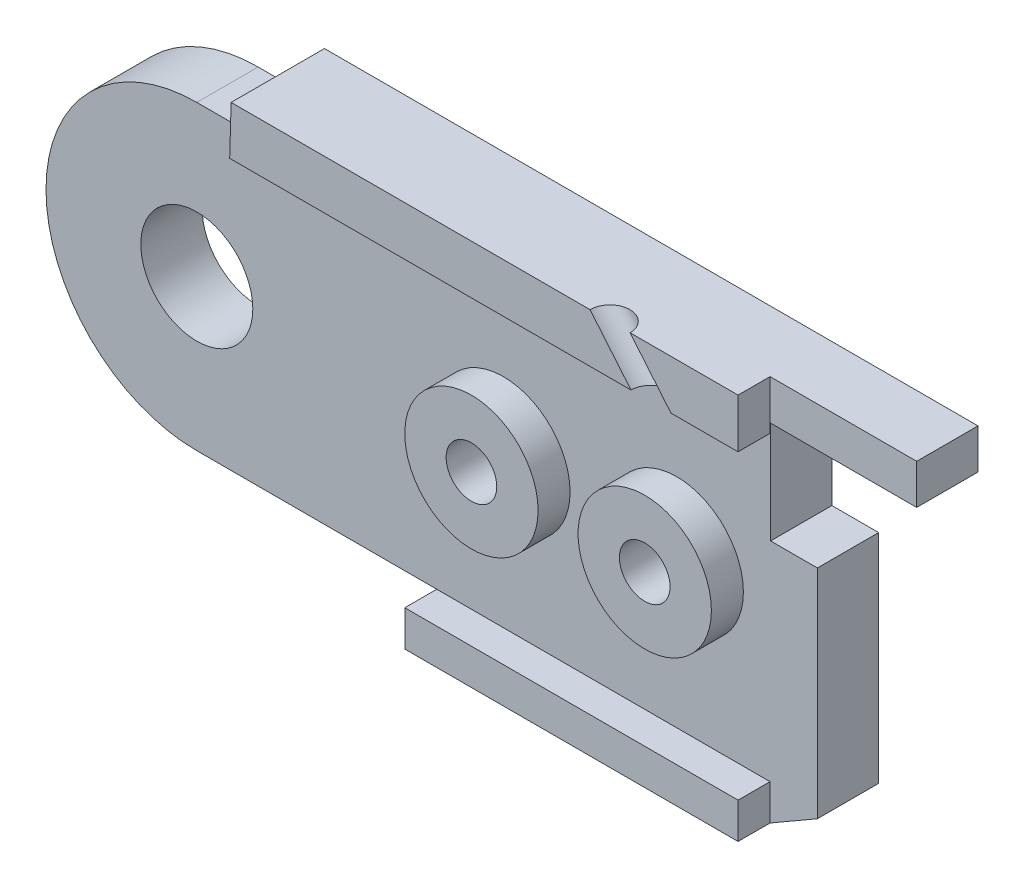
ISO-10303-21;
HEADER;
FILE_DESCRIPTION(('STEP AP214'),'2;1');
FILE_NAME('part.step','',(''),(''),'','','');
FILE_SCHEMA(('AUTOMOTIVE_DESIGN { 1 0 10303 214 1 1 1 1 }'));
ENDSEC;
DATA;
#1=APPLICATION_CONTEXT('core data for automotive mechanical design processes');
#2=APPLICATION_PROTOCOL_DEFINITION('international standard','automotive_design',2000,#1);
#3=PRODUCT_CONTEXT('',#1,'mechanical');
#4=PRODUCT('Part','Part','',(#3));
#5=PRODUCT_RELATED_PRODUCT_CATEGORY('part','',(#4));
#6=PRODUCT_DEFINITION_FORMATION('','',#4);
#7=PRODUCT_DEFINITION_CONTEXT('part definition',#1,'design');
#8=PRODUCT_DEFINITION('design','',#6,#7);
#9=PRODUCT_DEFINITION_SHAPE('','',#8);
#10=(LENGTH_UNIT() NAMED_UNIT(*) SI_UNIT(.MILLI.,.METRE.));
#11=(NAMED_UNIT(*) PLANE_ANGLE_UNIT() SI_UNIT($,.RADIAN.));
#12=(NAMED_UNIT(*) SI_UNIT($,.STERADIAN.) SOLID_ANGLE_UNIT());
#13=UNCERTAINTY_MEASURE_WITH_UNIT(LENGTH_MEASURE(1.E-05),#10,'distance_accuracy_value','');
#14=(GEOMETRIC_REPRESENTATION_CONTEXT(3) GLOBAL_UNCERTAINTY_ASSIGNED_CONTEXT((#13)) GLOBAL_UNIT_ASSIGNED_CONTEXT((#10,
#11,#12)) REPRESENTATION_CONTEXT('',''));
#15=CARTESIAN_POINT('',(0.,0.,0.));
#16=DIRECTION('',(0.,0.,1.));
#17=DIRECTION('',(1.,0.,0.));
#18=AXIS2_PLACEMENT_3D('',#15,#16,#17);
#19=CARTESIAN_POINT('',(0.,0.,8.));
#20=DIRECTION('',(0.,0.,1.));
#21=DIRECTION('',(1.,0.,0.));
#22=AXIS2_PLACEMENT_3D('',#19,#20,#21);
#23=PLANE('',#22);
#24=DIRECTION('',(0.640410196211525,-0.768033059567306,0.));
#25=VECTOR('',#24,1.);
#26=CARTESIAN_POINT('',(11.0813748573051,13.3371848451654,8.));
#27=LINE('',#26,#25);
#28=CARTESIAN_POINT('',(15.9486037421156,7.5,8.));
#29=VERTEX_POINT('',#28);
#30=CARTESIAN_POINT('',(17.4854768194204,5.65685424949238,8.));
#31=VERTEX_POINT('',#30);
#32=EDGE_CURVE('E12',#29,#31,#27,.T.);
#33=ORIENTED_EDGE('',*,*,#32,.F.);
#34=DIRECTION('',(-1.,0.,0.));
#35=VECTOR('',#34,1.);
#36=CARTESIAN_POINT('',(2.48679014755027,7.5,8.));
#37=LINE('',#36,#35);
#38=CARTESIAN_POINT('',(2.48679014755027,7.5,8.));
#39=VERTEX_POINT('',#38);
#40=EDGE_CURVE('E198',#29,#39,#37,.T.);
#41=ORIENTED_EDGE('',*,*,#40,.T.);
#42=DIRECTION('',(-0.0293404845923219,-0.999569475306188,0.));
#43=VECTOR('',#42,1.);
#44=CARTESIAN_POINT('',(2.48679014755027,7.5,8.));
#45=LINE('',#44,#43);
#46=CARTESIAN_POINT('',(2.4326880657739,5.65685424949238,8.));
#47=VERTEX_POINT('',#46);
#48=EDGE_CURVE('E191',#39,#47,#45,.T.);
#49=ORIENTED_EDGE('',*,*,#48,.T.);
#50=DIRECTION('',(1.,0.,0.));
#51=VECTOR('',#50,1.);
#52=CARTESIAN_POINT('',(2.4326880657739,5.65685424949238,8.));
#53=LINE('',#52,#51);
#54=EDGE_CURVE('E184',#47,#31,#53,.T.);
#55=ORIENTED_EDGE('',*,*,#54,.T.);
#56=EDGE_LOOP('',(#33,#41,#49,#55));
#57=FACE_BOUND('',#56,.T.);
#58=ADVANCED_FACE('F42',(#57),#23,.T.);
#59=CARTESIAN_POINT('',(0.,0.,6.8));
#60=DIRECTION('',(0.,0.,1.));
#61=DIRECTION('',(1.,0.,0.));
#62=AXIS2_PLACEMENT_3D('',#59,#60,#61);
#63=PLANE('',#62);
#64=CARTESIAN_POINT('',(18.,0.,6.8));
#65=DIRECTION('',(0.,0.,1.));
#66=DIRECTION('',(1.,0.,0.));
#67=AXIS2_PLACEMENT_3D('',#64,#65,#66);
#68=CIRCLE('',#67,2.5);
#69=CARTESIAN_POINT('',(20.5,0.,6.8));
#70=VERTEX_POINT('',#69);
#71=EDGE_CURVE('E436',#70,#70,#68,.T.);
#72=ORIENTED_EDGE('',*,*,#71,.F.);
#73=EDGE_LOOP('',(#72));
#74=FACE_BOUND('',#73,.T.);
#75=CARTESIAN_POINT('',(11.5,0.,6.8));
#76=DIRECTION('',(0.,0.,1.));
#77=DIRECTION('',(1.,0.,0.));
#78=AXIS2_PLACEMENT_3D('',#75,#76,#77);
#79=CIRCLE('',#78,2.5);
#80=CARTESIAN_POINT('',(14.,0.,6.8));
#81=VERTEX_POINT('',#80);
#82=EDGE_CURVE('E428',#81,#81,#79,.T.);
#83=ORIENTED_EDGE('',*,*,#82,.F.);
#84=EDGE_LOOP('',(#83));
#85=FACE_BOUND('',#84,.T.);
#86=DIRECTION('',(1.,0.,0.));
#87=VECTOR('',#86,1.);
#88=CARTESIAN_POINT('',(27.,2.1720062451962,6.8));
#89=LINE('',#88,#87);
#90=CARTESIAN_POINT('',(21.5203540034992,2.1720062451962,6.8));
#91=VERTEX_POINT('',#90);
#92=CARTESIAN_POINT('',(23.2751262658471,2.1720062451962,6.8));
#93=VERTEX_POINT('',#92);
#94=EDGE_CURVE('E421',#91,#93,#89,.T.);
#95=ORIENTED_EDGE('',*,*,#94,.F.);
#96=DIRECTION('',(0.,-1.,0.));
#97=VECTOR('',#96,1.);
#98=CARTESIAN_POINT('',(21.5203540034992,2.1720062451962,6.8));
#99=LINE('',#98,#97);
#100=CARTESIAN_POINT('',(21.5203540034992,6.,6.8));
#101=VERTEX_POINT('',#100);
#102=EDGE_CURVE('E415',#101,#91,#99,.T.);
#103=ORIENTED_EDGE('',*,*,#102,.F.);
#104=DIRECTION('',(-1.,0.,0.));
#105=VECTOR('',#104,1.);
#106=CARTESIAN_POINT('',(27.,6.,6.8));
#107=LINE('',#106,#105);
#108=CARTESIAN_POINT('',(27.,6.,6.8));
#109=VERTEX_POINT('',#108);
#110=EDGE_CURVE('E365',#109,#101,#107,.T.);
#111=ORIENTED_EDGE('',*,*,#110,.F.);
#112=DIRECTION('',(0.,1.,0.));
#113=VECTOR('',#112,1.);
#114=CARTESIAN_POINT('',(27.,7.5,6.8));
#115=LINE('',#114,#113);
#116=CARTESIAN_POINT('',(27.,7.5,6.8));
#117=VERTEX_POINT('',#116);
#118=EDGE_CURVE('E252',#109,#117,#115,.T.);
#119=ORIENTED_EDGE('',*,*,#118,.T.);
#120=DIRECTION('',(-1.,0.,0.));
#121=VECTOR('',#120,1.);
#122=CARTESIAN_POINT('',(27.,7.5,6.8));
#123=LINE('',#122,#121);
#124=CARTESIAN_POINT('',(21.5,7.5,6.8));
#125=VERTEX_POINT('',#124);
#126=EDGE_CURVE('E255',#117,#125,#123,.T.);
#127=ORIENTED_EDGE('',*,*,#126,.T.);
#128=DIRECTION('',(0.,1.,0.));
#129=VECTOR('',#128,1.);
#130=CARTESIAN_POINT('',(21.5,5.65685424949238,6.8));
#131=LINE('',#130,#129);
#132=CARTESIAN_POINT('',(21.5,5.65685424949238,6.8));
#133=VERTEX_POINT('',#132);
#134=EDGE_CURVE('E212',#133,#125,#131,.T.);
#135=ORIENTED_EDGE('',*,*,#134,.F.);
#136=DIRECTION('',(1.,0.,0.));
#137=VECTOR('',#136,1.);
#138=CARTESIAN_POINT('',(2.4326880657739,5.65685424949238,6.8));
#139=LINE('',#138,#137);
#140=CARTESIAN_POINT('',(2.4326880657739,5.65685424949238,6.8));
#141=VERTEX_POINT('',#140);
#142=EDGE_CURVE('E208',#141,#133,#139,.T.);
#143=ORIENTED_EDGE('',*,*,#142,.F.);
#144=DIRECTION('',(-1.,0.,0.));
#145=VECTOR('',#144,1.);
#146=CARTESIAN_POINT('',(2.4326880657739,5.65685424949238,6.8));
#147=LINE('',#146,#145);
#148=CARTESIAN_POINT('',(0.,5.65685424949238,6.8));
#149=VERTEX_POINT('',#148);
#150=EDGE_CURVE('E258',#141,#149,#147,.T.);
#151=ORIENTED_EDGE('',*,*,#150,.T.);
#152=CARTESIAN_POINT('',(0.,0.,6.8));
#153=DIRECTION('',(0.,0.,1.));
#154=DIRECTION('',(1.,0.,0.));
#155=AXIS2_PLACEMENT_3D('',#152,#153,#154);
#156=CIRCLE('',#155,5.65685424949238);
#157=CARTESIAN_POINT('',(0.,-5.65685424949238,6.8));
#158=VERTEX_POINT('',#157);
#159=EDGE_CURVE('E236',#149,#158,#156,.T.);
#160=ORIENTED_EDGE('',*,*,#159,.T.);
#161=DIRECTION('',(1.,0.,0.));
#162=VECTOR('',#161,1.);
#163=CARTESIAN_POINT('',(9.,-5.65685424949238,6.8));
#164=LINE('',#163,#162);
#165=CARTESIAN_POINT('',(9.,-5.65685424949238,6.8));
#166=VERTEX_POINT('',#165);
#167=EDGE_CURVE('E240',#158,#166,#164,.T.);
#168=ORIENTED_EDGE('',*,*,#167,.T.);
#169=DIRECTION('',(-1.,0.,0.));
#170=VECTOR('',#169,1.);
#171=CARTESIAN_POINT('',(21.5,-5.65685424949238,6.8));
#172=LINE('',#171,#170);
#173=CARTESIAN_POINT('',(21.5,-5.65685424949238,6.8));
#174=VERTEX_POINT('',#173);
#175=EDGE_CURVE('E404',#174,#166,#172,.T.);
#176=ORIENTED_EDGE('',*,*,#175,.F.);
#177=DIRECTION('',(0.,1.,0.));
#178=VECTOR('',#177,1.);
#179=CARTESIAN_POINT('',(21.5,-6.99999999999999,6.8));
#180=LINE('',#179,#178);
#181=CARTESIAN_POINT('',(21.5,-6.99999999999999,6.8));
#182=VERTEX_POINT('',#181);
#183=EDGE_CURVE('E401',#182,#174,#180,.T.);
#184=ORIENTED_EDGE('',*,*,#183,.F.);
#185=DIRECTION('',(0.865971186561437,0.500093895229063,0.));
#186=VECTOR('',#185,1.);
#187=CARTESIAN_POINT('',(21.5,-6.99999999999999,6.8));
#188=LINE('',#187,#186);
#189=CARTESIAN_POINT('',(23.2751262658471,-5.97487373415292,6.8));
#190=VERTEX_POINT('',#189);
#191=EDGE_CURVE('E245',#182,#190,#188,.T.);
#192=ORIENTED_EDGE('',*,*,#191,.T.);
#193=DIRECTION('',(0.,1.,0.));
#194=VECTOR('',#193,1.);
#195=CARTESIAN_POINT('',(23.2751262658471,-5.97487373415292,6.8));
#196=LINE('',#195,#194);
#197=EDGE_CURVE('E248',#190,#93,#196,.T.);
#198=ORIENTED_EDGE('',*,*,#197,.T.);
#199=EDGE_LOOP('',(#95,#103,#111,#119,#127,#135,#143,#151,#160,#168,#176,#184,#192,#198));
#200=FACE_BOUND('',#199,.T.);
#201=CARTESIAN_POINT('',(0.,0.,6.8));
#202=DIRECTION('',(0.,0.,1.));
#203=DIRECTION('',(1.,0.,0.));
#204=AXIS2_PLACEMENT_3D('',#201,#202,#203);
#205=CIRCLE('',#204,2.1);
#206=CARTESIAN_POINT('',(2.1,0.,6.8));
#207=VERTEX_POINT('',#206);
#208=EDGE_CURVE('E227',#207,#207,#205,.T.);
#209=ORIENTED_EDGE('',*,*,#208,.F.);
#210=EDGE_LOOP('',(#209));
#211=FACE_BOUND('',#210,.T.);
#212=ADVANCED_FACE('F360',(#74,#85,#200,#211),#63,.T.);
#213=CARTESIAN_POINT('',(0.,0.,6.8));
#214=DIRECTION('',(0.,0.,-1.));
#215=DIRECTION('',(-1.,0.,0.));
#216=AXIS2_PLACEMENT_3D('',#213,#214,#215);
#217=CYLINDRICAL_SURFACE('',#216,5.65685424949238);
#218=CARTESIAN_POINT('',(0.,0.,4.5));
#219=DIRECTION('',(0.,0.,1.));
#220=DIRECTION('',(1.,0.,0.));
#221=AXIS2_PLACEMENT_3D('',#218,#219,#220);
#222=CIRCLE('',#221,5.65685424949238);
#223=CARTESIAN_POINT('',(0.,5.65685424949238,4.5));
#224=VERTEX_POINT('',#223);
#225=CARTESIAN_POINT('',(0.,-5.65685424949238,4.5));
#226=VERTEX_POINT('',#225);
#227=EDGE_CURVE('E232',#224,#226,#222,.T.);
#228=ORIENTED_EDGE('',*,*,#227,.T.);
#229=DIRECTION('',(0.,0.,-1.));
#230=VECTOR('',#229,1.);
#231=CARTESIAN_POINT('',(0.,-5.65685424949238,6.8));
#232=LINE('',#231,#230);
#233=EDGE_CURVE('E326',#158,#226,#232,.T.);
#234=ORIENTED_EDGE('',*,*,#233,.F.);
#235=ORIENTED_EDGE('',*,*,#159,.F.);
#236=DIRECTION('',(0.,0.,-1.));
#237=VECTOR('',#236,1.);
#238=CARTESIAN_POINT('',(0.,5.65685424949238,6.8));
#239=LINE('',#238,#237);
#240=EDGE_CURVE('E261',#149,#224,#239,.T.);
#241=ORIENTED_EDGE('',*,*,#240,.T.);
#242=EDGE_LOOP('',(#228,#234,#235,#241));
#243=FACE_BOUND('',#242,.T.);
#244=ADVANCED_FACE('F44',(#243),#217,.T.);
#245=CARTESIAN_POINT('',(9.,-5.65685424949238,6.8));
#246=DIRECTION('',(0.,1.,0.));
#247=DIRECTION('',(0.,0.,1.));
#248=AXIS2_PLACEMENT_3D('',#245,#246,#247);
#249=PLANE('',#248);
#250=DIRECTION('',(1.,0.,0.));
#251=VECTOR('',#250,1.);
#252=CARTESIAN_POINT('',(9.,-5.65685424949238,4.5));
#253=LINE('',#252,#251);
#254=CARTESIAN_POINT('',(9.,-5.65685424949238,4.5));
#255=VERTEX_POINT('',#254);
#256=EDGE_CURVE('E265',#226,#255,#253,.T.);
#257=ORIENTED_EDGE('',*,*,#256,.T.);
#258=DIRECTION('',(0.,0.,-1.));
#259=VECTOR('',#258,1.);
#260=CARTESIAN_POINT('',(9.,-5.65685424949238,6.8));
#261=LINE('',#260,#259);
#262=EDGE_CURVE('E322',#166,#255,#261,.T.);
#263=ORIENTED_EDGE('',*,*,#262,.F.);
#264=ORIENTED_EDGE('',*,*,#167,.F.);
#265=ORIENTED_EDGE('',*,*,#233,.T.);
#266=EDGE_LOOP('',(#257,#263,#264,#265));
#267=FACE_BOUND('',#266,.T.);
#268=ADVANCED_FACE('F560',(#267),#249,.F.);
#269=CARTESIAN_POINT('',(9.,-6.99999999999999,6.8));
#270=DIRECTION('',(1.,0.,0.));
#271=DIRECTION('',(0.,0.,-1.));
#272=AXIS2_PLACEMENT_3D('',#269,#270,#271);
#273=PLANE('',#272);
#274=DIRECTION('',(0.,-1.,0.));
#275=VECTOR('',#274,1.);
#276=CARTESIAN_POINT('',(9.,-6.99999999999999,4.5));
#277=LINE('',#276,#275);
#278=CARTESIAN_POINT('',(9.,-6.99999999999999,4.5));
#279=VERTEX_POINT('',#278);
#280=EDGE_CURVE('E268',#255,#279,#277,.T.);
#281=ORIENTED_EDGE('',*,*,#280,.T.);
#282=DIRECTION('',(0.,0.,-1.));
#283=VECTOR('',#282,1.);
#284=CARTESIAN_POINT('',(9.,-6.99999999999999,6.8));
#285=LINE('',#284,#283);
#286=CARTESIAN_POINT('',(9.,-6.99999999999999,8.));
#287=VERTEX_POINT('',#286);
#288=EDGE_CURVE('E318',#287,#279,#285,.T.);
#289=ORIENTED_EDGE('',*,*,#288,.F.);
#290=DIRECTION('',(0.,-1.,0.));
#291=VECTOR('',#290,1.);
#292=CARTESIAN_POINT('',(9.,-5.65685424949238,8.));
#293=LINE('',#292,#291);
#294=CARTESIAN_POINT('',(9.,-5.65685424949238,8.));
#295=VERTEX_POINT('',#294);
#296=EDGE_CURVE('E393',#295,#287,#293,.T.);
#297=ORIENTED_EDGE('',*,*,#296,.F.);
#298=DIRECTION('',(0.,0.,-1.));
#299=VECTOR('',#298,1.);
#300=CARTESIAN_POINT('',(9.,-5.65685424949238,8.));
#301=LINE('',#300,#299);
#302=EDGE_CURVE('E213',#295,#166,#301,.T.);
#303=ORIENTED_EDGE('',*,*,#302,.T.);
#304=ORIENTED_EDGE('',*,*,#262,.T.);
#305=EDGE_LOOP('',(#281,#289,#297,#303,#304));
#306=FACE_BOUND('',#305,.T.);
#307=ADVANCED_FACE('F557',(#306),#273,.F.);
#308=CARTESIAN_POINT('',(9.,-6.99999999999999,6.8));
#309=DIRECTION('',(0.,1.,0.));
#310=DIRECTION('',(-1.,0.,0.));
#311=AXIS2_PLACEMENT_3D('',#308,#309,#310);
#312=PLANE('',#311);
#313=DIRECTION('',(1.,0.,0.));
#314=VECTOR('',#313,1.);
#315=CARTESIAN_POINT('',(9.,-6.99999999999999,4.5));
#316=LINE('',#315,#314);
#317=CARTESIAN_POINT('',(21.5,-6.99999999999999,4.5));
#318=VERTEX_POINT('',#317);
#319=EDGE_CURVE('E271',#279,#318,#316,.T.);
#320=ORIENTED_EDGE('',*,*,#319,.T.);
#321=DIRECTION('',(0.,0.,-1.));
#322=VECTOR('',#321,1.);
#323=CARTESIAN_POINT('',(21.5,-6.99999999999999,6.8));
#324=LINE('',#323,#322);
#325=EDGE_CURVE('E314',#182,#318,#324,.T.);
#326=ORIENTED_EDGE('',*,*,#325,.F.);
#327=DIRECTION('',(0.,0.,-1.));
#328=VECTOR('',#327,1.);
#329=CARTESIAN_POINT('',(21.5,-6.99999999999999,8.));
#330=LINE('',#329,#328);
#331=CARTESIAN_POINT('',(21.5,-6.99999999999999,8.));
#332=VERTEX_POINT('',#331);
#333=EDGE_CURVE('E381',#332,#182,#330,.T.);
#334=ORIENTED_EDGE('',*,*,#333,.F.);
#335=DIRECTION('',(1.,0.,0.));
#336=VECTOR('',#335,1.);
#337=CARTESIAN_POINT('',(9.,-6.99999999999999,8.));
#338=LINE('',#337,#336);
#339=EDGE_CURVE('E390',#287,#332,#338,.T.);
#340=ORIENTED_EDGE('',*,*,#339,.F.);
#341=ORIENTED_EDGE('',*,*,#288,.T.);
#342=EDGE_LOOP('',(#320,#326,#334,#340,#341));
#343=FACE_BOUND('',#342,.T.);
#344=ADVANCED_FACE('F553',(#343),#312,.F.);
#345=CARTESIAN_POINT('',(21.5,-6.99999999999999,6.8));
#346=DIRECTION('',(-0.500093895229063,0.865971186561437,0.));
#347=DIRECTION('',(-0.865971186561437,-0.500093895229063,0.));
#348=AXIS2_PLACEMENT_3D('',#345,#346,#347);
#349=PLANE('',#348);
#350=DIRECTION('',(0.865971186561437,0.500093895229063,0.));
#351=VECTOR('',#350,1.);
#352=CARTESIAN_POINT('',(21.5,-6.99999999999999,4.5));
#353=LINE('',#352,#351);
#354=CARTESIAN_POINT('',(23.2751262658471,-5.97487373415292,4.5));
#355=VERTEX_POINT('',#354);
#356=EDGE_CURVE('E274',#318,#355,#353,.T.);
#357=ORIENTED_EDGE('',*,*,#356,.T.);
#358=DIRECTION('',(0.,0.,-1.));
#359=VECTOR('',#358,1.);
#360=CARTESIAN_POINT('',(23.2751262658471,-5.97487373415292,6.8));
#361=LINE('',#360,#359);
#362=EDGE_CURVE('E310',#190,#355,#361,.T.);
#363=ORIENTED_EDGE('',*,*,#362,.F.);
#364=ORIENTED_EDGE('',*,*,#191,.F.);
#365=ORIENTED_EDGE('',*,*,#325,.T.);
#366=EDGE_LOOP('',(#357,#363,#364,#365));
#367=FACE_BOUND('',#366,.T.);
#368=ADVANCED_FACE('F547',(#367),#349,.F.);
#369=CARTESIAN_POINT('',(23.2751262658471,-5.97487373415292,6.8));
#370=DIRECTION('',(-1.,0.,0.));
#371=DIRECTION('',(0.,0.,1.));
#372=AXIS2_PLACEMENT_3D('',#369,#370,#371);
#373=PLANE('',#372);
#374=DIRECTION('',(0.,1.,0.));
#375=VECTOR('',#374,1.);
#376=CARTESIAN_POINT('',(23.2751262658471,-5.97487373415292,4.5));
#377=LINE('',#376,#375);
#378=CARTESIAN_POINT('',(23.2751262658471,2.1720062451962,4.5));
#379=VERTEX_POINT('',#378);
#380=EDGE_CURVE('E277',#355,#379,#377,.T.);
#381=ORIENTED_EDGE('',*,*,#380,.T.);
#382=DIRECTION('',(0.,0.,-1.));
#383=VECTOR('',#382,1.);
#384=CARTESIAN_POINT('',(23.2751262658471,2.1720062451962,6.8));
#385=LINE('',#384,#383);
#386=EDGE_CURVE('E307',#93,#379,#385,.T.);
#387=ORIENTED_EDGE('',*,*,#386,.F.);
#388=ORIENTED_EDGE('',*,*,#197,.F.);
#389=ORIENTED_EDGE('',*,*,#362,.T.);
#390=EDGE_LOOP('',(#381,#387,#388,#389));
#391=FACE_BOUND('',#390,.T.);
#392=ADVANCED_FACE('F543',(#391),#373,.F.);
#393=CARTESIAN_POINT('',(27.,7.5,6.8));
#394=DIRECTION('',(-1.,0.,0.));
#395=DIRECTION('',(0.,0.,1.));
#396=AXIS2_PLACEMENT_3D('',#393,#394,#395);
#397=PLANE('',#396);
#398=ORIENTED_EDGE('',*,*,#118,.F.);
#399=DIRECTION('',(0.,0.,1.));
#400=VECTOR('',#399,1.);
#401=CARTESIAN_POINT('',(27.,6.,4.4));
#402=LINE('',#401,#400);
#403=CARTESIAN_POINT('',(27.,6.,4.5));
#404=VERTEX_POINT('',#403);
#405=EDGE_CURVE('E370',#404,#109,#402,.T.);
#406=ORIENTED_EDGE('',*,*,#405,.F.);
#407=DIRECTION('',(0.,1.,0.));
#408=VECTOR('',#407,1.);
#409=CARTESIAN_POINT('',(27.,7.5,4.5));
#410=LINE('',#409,#408);
#411=CARTESIAN_POINT('',(27.,7.5,4.5));
#412=VERTEX_POINT('',#411);
#413=EDGE_CURVE('E281',#404,#412,#410,.T.);
#414=ORIENTED_EDGE('',*,*,#413,.T.);
#415=DIRECTION('',(0.,0.,-1.));
#416=VECTOR('',#415,1.);
#417=CARTESIAN_POINT('',(27.,7.5,6.8));
#418=LINE('',#417,#416);
#419=EDGE_CURVE('E303',#117,#412,#418,.T.);
#420=ORIENTED_EDGE('',*,*,#419,.F.);
#421=EDGE_LOOP('',(#398,#406,#414,#420));
#422=FACE_BOUND('',#421,.T.);
#423=ADVANCED_FACE('F368',(#422),#397,.F.);
#424=CARTESIAN_POINT('',(27.,7.5,6.8));
#425=DIRECTION('',(0.,-1.,0.));
#426=DIRECTION('',(1.,0.,0.));
#427=AXIS2_PLACEMENT_3D('',#424,#425,#426);
#428=PLANE('',#427);
#429=ORIENTED_EDGE('',*,*,#40,.F.);
#430=CARTESIAN_POINT('',(15.9486037421156,7.5,8.));
#431=CARTESIAN_POINT('',(15.9485828223259,7.5,7.96299421800191));
#432=CARTESIAN_POINT('',(15.9513415433594,7.5,7.92599480882229));
#433=CARTESIAN_POINT('',(15.9622658553059,7.5,7.85280214845709));
#434=CARTESIAN_POINT('',(15.9704314462188,7.5,7.81660889727152));
#435=CARTESIAN_POINT('',(15.9921393934185,7.5,7.74542087657391));
#436=CARTESIAN_POINT('',(16.0057416320877,7.5,7.71044433655034));
#437=CARTESIAN_POINT('',(16.038007282868,7.5,7.64291055089048));
#438=CARTESIAN_POINT('',(16.0566711070594,7.5,7.61035350250797));
#439=CARTESIAN_POINT('',(16.1009739517884,7.5,7.54495610451522));
#440=CARTESIAN_POINT('',(16.1271556218163,7.5,7.51248144744488));
#441=CARTESIAN_POINT('',(16.1845300787262,7.5,7.45231690208434));
#442=CARTESIAN_POINT('',(16.215722865608,7.5,7.42462701379413));
#443=CARTESIAN_POINT('',(16.2822616845173,7.5,7.37479057971385));
#444=CARTESIAN_POINT('',(16.3176077165447,7.5,7.3526440339238));
#445=CARTESIAN_POINT('',(16.3914774729578,7.5,7.3145064968947));
#446=CARTESIAN_POINT('',(16.4300011973436,7.5,7.29851550565565));
#447=CARTESIAN_POINT('',(16.509163978992,7.5,7.27312976103131));
#448=CARTESIAN_POINT('',(16.5498030362547,7.5,7.26373500764601));
#449=CARTESIAN_POINT('',(16.632075555852,7.5,7.25180095836177));
#450=CARTESIAN_POINT('',(16.6737090181867,7.5,7.24926166246284));
#451=CARTESIAN_POINT('',(16.7568220529829,7.5,7.2511085370352));
#452=CARTESIAN_POINT('',(16.7983016254444,7.5,7.25549470750648));
#453=CARTESIAN_POINT('',(16.8799628150021,7.5,7.27107155208883));
#454=CARTESIAN_POINT('',(16.9201444320982,7.5,7.28226222619989));
#455=CARTESIAN_POINT('',(16.9981014450578,7.5,7.31113939718431));
#456=CARTESIAN_POINT('',(17.0358768409213,7.5,7.32882589405766));
#457=CARTESIAN_POINT('',(17.1079795264237,7.5,7.37020698670185));
#458=CARTESIAN_POINT('',(17.1423068160626,7.5,7.3939015824727));
#459=CARTESIAN_POINT('',(17.2065664512203,7.5,7.44664499570797));
#460=CARTESIAN_POINT('',(17.2364987967392,7.5,7.4756938131724));
#461=CARTESIAN_POINT('',(17.2911431356884,7.5,7.5383457625048));
#462=CARTESIAN_POINT('',(17.3158551291189,7.5,7.57194889437277));
#463=CARTESIAN_POINT('',(17.3593765510825,7.5,7.64277780637736));
#464=CARTESIAN_POINT('',(17.3781859796156,7.5,7.68000358651398));
#465=CARTESIAN_POINT('',(17.4093858052971,7.5,7.75706914341449));
#466=CARTESIAN_POINT('',(17.4217762024454,7.5,7.79690892017838));
#467=CARTESIAN_POINT('',(17.4366988841339,7.5,7.86412407662256));
#468=CARTESIAN_POINT('',(17.4411547413667,7.5,7.89108809517031));
#469=CARTESIAN_POINT('',(17.4471101011285,7.5,7.945363879891));
#470=CARTESIAN_POINT('',(17.4486070790076,7.5,7.97267592303649));
#471=CARTESIAN_POINT('',(17.4486037421156,7.5,7.99999999999999));
#472=B_SPLINE_CURVE_WITH_KNOTS('',3,(#430,#431,#432,#433,#434,#435,#436,#437,#438,#439,#440,
#441,#442,#443,#444,#445,#446,#447,#448,#449,#450,#451,#452,#453,#454,#455,#456,#457,#458,#459,
#460,#461,#462,#463,#464,#465,#466,#467,#468,#469,#470,#471),.UNSPECIFIED.,.F.,.F.,(4,2,2,2,2,2,
2,2,2,2,2,2,2,2,2,2,2,2,2,2,4),(0.,0.110905075743071,0.221810151486143,0.333972034634098,
0.446143051990056,0.570700323775496,0.695257595560365,0.819814867345232,0.944372139130096,
1.06892941091496,1.19348668269983,1.31804395448469,1.44260122626956,1.56715849805442,
1.69171576983929,1.81627304162415,1.94083031340901,2.06538758519388,2.18994485697874,
2.27178284385731,2.35369062852365),.UNSPECIFIED.);
#473=CARTESIAN_POINT('',(17.4486037421156,7.5,8.));
#474=VERTEX_POINT('',#473);
#475=EDGE_CURVE('E176',#29,#474,#472,.T.);
#476=ORIENTED_EDGE('',*,*,#475,.T.);
#477=CARTESIAN_POINT('',(21.5,7.5,8.));
#478=VERTEX_POINT('',#477);
#479=EDGE_CURVE('E203',#478,#474,#37,.T.);
#480=ORIENTED_EDGE('',*,*,#479,.F.);
#481=DIRECTION('',(0.,0.,-1.));
#482=VECTOR('',#481,1.);
#483=CARTESIAN_POINT('',(21.5,7.5,8.));
#484=LINE('',#483,#482);
#485=EDGE_CURVE('E207',#478,#125,#484,.T.);
#486=ORIENTED_EDGE('',*,*,#485,.T.);
#487=ORIENTED_EDGE('',*,*,#126,.F.);
#488=ORIENTED_EDGE('',*,*,#419,.T.);
#489=DIRECTION('',(-1.,0.,0.));
#490=VECTOR('',#489,1.);
#491=CARTESIAN_POINT('',(27.,7.5,4.5));
#492=LINE('',#491,#490);
#493=CARTESIAN_POINT('',(2.48679014755027,7.5,4.5));
#494=VERTEX_POINT('',#493);
#495=EDGE_CURVE('E284',#412,#494,#492,.T.);
#496=ORIENTED_EDGE('',*,*,#495,.T.);
#497=DIRECTION('',(0.,0.,-1.));
#498=VECTOR('',#497,1.);
#499=CARTESIAN_POINT('',(2.48679014755027,7.5,6.8));
#500=LINE('',#499,#498);
#501=EDGE_CURVE('E299',#39,#494,#500,.T.);
#502=ORIENTED_EDGE('',*,*,#501,.F.);
#503=EDGE_LOOP('',(#429,#476,#480,#486,#487,#488,#496,#502));
#504=FACE_BOUND('',#503,.T.);
#505=ADVANCED_FACE('F345',(#504),#428,.F.);
#506=CARTESIAN_POINT('',(2.4326880657739,5.65685424949238,6.8));
#507=DIRECTION('',(0.999569475306188,-0.0293404845923219,0.));
#508=DIRECTION('',(0.0293404845923219,0.999569475306188,0.));
#509=AXIS2_PLACEMENT_3D('',#506,#507,#508);
#510=PLANE('',#509);
#511=DIRECTION('',(-0.0293404845923219,-0.999569475306188,0.));
#512=VECTOR('',#511,1.);
#513=CARTESIAN_POINT('',(2.4326880657739,5.65685424949238,4.5));
#514=LINE('',#513,#512);
#515=CARTESIAN_POINT('',(2.4326880657739,5.65685424949238,4.5));
#516=VERTEX_POINT('',#515);
#517=EDGE_CURVE('E287',#494,#516,#514,.T.);
#518=ORIENTED_EDGE('',*,*,#517,.T.);
#519=DIRECTION('',(0.,0.,-1.));
#520=VECTOR('',#519,1.);
#521=CARTESIAN_POINT('',(2.4326880657739,5.65685424949238,6.8));
#522=LINE('',#521,#520);
#523=EDGE_CURVE('E295',#141,#516,#522,.T.);
#524=ORIENTED_EDGE('',*,*,#523,.F.);
#525=DIRECTION('',(0.,0.,-1.));
#526=VECTOR('',#525,1.);
#527=CARTESIAN_POINT('',(2.4326880657739,5.65685424949238,8.));
#528=LINE('',#527,#526);
#529=EDGE_CURVE('E224',#47,#141,#528,.T.);
#530=ORIENTED_EDGE('',*,*,#529,.F.);
#531=ORIENTED_EDGE('',*,*,#48,.F.);
#532=ORIENTED_EDGE('',*,*,#501,.T.);
#533=EDGE_LOOP('',(#518,#524,#530,#531,#532));
#534=FACE_BOUND('',#533,.T.);
#535=ADVANCED_FACE('F376',(#534),#510,.F.);
#536=CARTESIAN_POINT('',(2.4326880657739,5.65685424949238,6.8));
#537=DIRECTION('',(0.,-1.,0.));
#538=DIRECTION('',(0.,0.,-1.));
#539=AXIS2_PLACEMENT_3D('',#536,#537,#538);
#540=PLANE('',#539);
#541=DIRECTION('',(-1.,0.,0.));
#542=VECTOR('',#541,1.);
#543=CARTESIAN_POINT('',(2.4326880657739,5.65685424949238,4.5));
#544=LINE('',#543,#542);
#545=EDGE_CURVE('E241',#516,#224,#544,.T.);
#546=ORIENTED_EDGE('',*,*,#545,.T.);
#547=ORIENTED_EDGE('',*,*,#240,.F.);
#548=ORIENTED_EDGE('',*,*,#150,.F.);
#549=ORIENTED_EDGE('',*,*,#523,.T.);
#550=EDGE_LOOP('',(#546,#547,#548,#549));
#551=FACE_BOUND('',#550,.T.);
#552=ADVANCED_FACE('F526',(#551),#540,.F.);
#553=CARTESIAN_POINT('',(0.,0.,4.5));
#554=DIRECTION('',(0.,0.,1.));
#555=DIRECTION('',(1.,0.,0.));
#556=AXIS2_PLACEMENT_3D('',#553,#554,#555);
#557=CYLINDRICAL_SURFACE('',#556,2.1);
#558=CARTESIAN_POINT('',(0.,0.,4.5));
#559=DIRECTION('',(0.,0.,1.));
#560=DIRECTION('',(1.,0.,0.));
#561=AXIS2_PLACEMENT_3D('',#558,#559,#560);
#562=CIRCLE('',#561,2.1);
#563=CARTESIAN_POINT('',(2.1,0.,4.5));
#564=VERTEX_POINT('',#563);
#565=EDGE_CURVE('E228',#564,#564,#562,.T.);
#566=ORIENTED_EDGE('',*,*,#565,.F.);
#567=EDGE_LOOP('',(#566));
#568=FACE_BOUND('',#567,.T.);
#569=ORIENTED_EDGE('',*,*,#208,.T.);
#570=EDGE_LOOP('',(#569));
#571=FACE_BOUND('',#570,.T.);
#572=ADVANCED_FACE('F523',(#568,#571),#557,.F.);
#573=CARTESIAN_POINT('',(2.4326880657739,5.65685424949238,8.));
#574=DIRECTION('',(0.,1.,0.));
#575=DIRECTION('',(0.,0.,1.));
#576=AXIS2_PLACEMENT_3D('',#573,#574,#575);
#577=PLANE('',#576);
#578=CARTESIAN_POINT('',(18.9854768194204,5.65685424949238,8.));
#579=VERTEX_POINT('',#578);
#580=CARTESIAN_POINT('',(21.5,5.65685424949238,8.));
#581=VERTEX_POINT('',#580);
#582=EDGE_CURVE('E187',#579,#581,#53,.T.);
#583=ORIENTED_EDGE('',*,*,#582,.F.);
#584=CARTESIAN_POINT('',(18.2354768194204,5.65685424949238,8.));
#585=DIRECTION('',(0.,-1.,0.));
#586=DIRECTION('',(0.,0.,-1.));
#587=AXIS2_PLACEMENT_3D('',#584,#585,#586);
#588=CIRCLE('',#587,0.750000000000002);
#589=EDGE_CURVE('E57',#31,#579,#588,.T.);
#590=ORIENTED_EDGE('',*,*,#589,.F.);
#591=ORIENTED_EDGE('',*,*,#54,.F.);
#592=ORIENTED_EDGE('',*,*,#529,.T.);
#593=ORIENTED_EDGE('',*,*,#142,.T.);
#594=DIRECTION('',(0.,0.,-1.));
#595=VECTOR('',#594,1.);
#596=CARTESIAN_POINT('',(21.5,5.65685424949238,8.));
#597=LINE('',#596,#595);
#598=EDGE_CURVE('E220',#581,#133,#597,.T.);
#599=ORIENTED_EDGE('',*,*,#598,.F.);
#600=EDGE_LOOP('',(#583,#590,#591,#592,#593,#599));
#601=FACE_BOUND('',#600,.T.);
#602=ADVANCED_FACE('F182',(#601),#577,.F.);
#603=CARTESIAN_POINT('',(21.5,5.65685424949238,8.));
#604=DIRECTION('',(-1.,0.,0.));
#605=DIRECTION('',(0.,0.,1.));
#606=AXIS2_PLACEMENT_3D('',#603,#604,#605);
#607=PLANE('',#606);
#608=ORIENTED_EDGE('',*,*,#134,.T.);
#609=ORIENTED_EDGE('',*,*,#485,.F.);
#610=DIRECTION('',(0.,1.,0.));
#611=VECTOR('',#610,1.);
#612=CARTESIAN_POINT('',(21.5,5.65685424949238,8.));
#613=LINE('',#612,#611);
#614=EDGE_CURVE('E194',#581,#478,#613,.T.);
#615=ORIENTED_EDGE('',*,*,#614,.F.);
#616=ORIENTED_EDGE('',*,*,#598,.T.);
#617=EDGE_LOOP('',(#608,#609,#615,#616));
#618=FACE_BOUND('',#617,.T.);
#619=ADVANCED_FACE('F354',(#618),#607,.F.);
#620=DIRECTION('',(0.640410196211525,-0.768033059567306,0.));
#621=VECTOR('',#620,1.);
#622=CARTESIAN_POINT('',(12.5813748573051,13.3371848451654,8.));
#623=LINE('',#622,#621);
#624=EDGE_CURVE('E51',#579,#474,#623,.F.);
#625=ORIENTED_EDGE('',*,*,#624,.F.);
#626=ORIENTED_EDGE('',*,*,#582,.T.);
#627=ORIENTED_EDGE('',*,*,#614,.T.);
#628=ORIENTED_EDGE('',*,*,#479,.T.);
#629=EDGE_LOOP('',(#625,#626,#627,#628));
#630=FACE_BOUND('',#629,.T.);
#631=ADVANCED_FACE('F350',(#630),#23,.T.);
#632=CARTESIAN_POINT('',(21.5,-5.65685424949238,8.));
#633=DIRECTION('',(0.,-1.,0.));
#634=DIRECTION('',(0.,0.,-1.));
#635=AXIS2_PLACEMENT_3D('',#632,#633,#634);
#636=PLANE('',#635);
#637=ORIENTED_EDGE('',*,*,#175,.T.);
#638=ORIENTED_EDGE('',*,*,#302,.F.);
#639=DIRECTION('',(-1.,0.,0.));
#640=VECTOR('',#639,1.);
#641=CARTESIAN_POINT('',(21.5,-5.65685424949238,8.));
#642=LINE('',#641,#640);
#643=CARTESIAN_POINT('',(21.5,-5.65685424949238,8.));
#644=VERTEX_POINT('',#643);
#645=EDGE_CURVE('E397',#644,#295,#642,.T.);
#646=ORIENTED_EDGE('',*,*,#645,.F.);
#647=DIRECTION('',(0.,0.,-1.));
#648=VECTOR('',#647,1.);
#649=CARTESIAN_POINT('',(21.5,-5.65685424949238,8.));
#650=LINE('',#649,#648);
#651=EDGE_CURVE('E383',#644,#174,#650,.T.);
#652=ORIENTED_EDGE('',*,*,#651,.T.);
#653=EDGE_LOOP('',(#637,#638,#646,#652));
#654=FACE_BOUND('',#653,.T.);
#655=ADVANCED_FACE('F512',(#654),#636,.F.);
#656=CARTESIAN_POINT('',(21.5,-6.99999999999999,8.));
#657=DIRECTION('',(-1.,0.,0.));
#658=DIRECTION('',(0.,0.,1.));
#659=AXIS2_PLACEMENT_3D('',#656,#657,#658);
#660=PLANE('',#659);
#661=ORIENTED_EDGE('',*,*,#183,.T.);
#662=ORIENTED_EDGE('',*,*,#651,.F.);
#663=DIRECTION('',(0.,1.,0.));
#664=VECTOR('',#663,1.);
#665=CARTESIAN_POINT('',(21.5,-6.99999999999999,8.));
#666=LINE('',#665,#664);
#667=EDGE_CURVE('E387',#332,#644,#666,.T.);
#668=ORIENTED_EDGE('',*,*,#667,.F.);
#669=ORIENTED_EDGE('',*,*,#333,.T.);
#670=EDGE_LOOP('',(#661,#662,#668,#669));
#671=FACE_BOUND('',#670,.T.);
#672=ADVANCED_FACE('F508',(#671),#660,.F.);
#673=CARTESIAN_POINT('',(0.,0.,8.));
#674=DIRECTION('',(0.,0.,1.));
#675=DIRECTION('',(1.,0.,0.));
#676=AXIS2_PLACEMENT_3D('',#673,#674,#675);
#677=PLANE('',#676);
#678=ORIENTED_EDGE('',*,*,#645,.T.);
#679=ORIENTED_EDGE('',*,*,#296,.T.);
#680=ORIENTED_EDGE('',*,*,#339,.T.);
#681=ORIENTED_EDGE('',*,*,#667,.T.);
#682=EDGE_LOOP('',(#678,#679,#680,#681));
#683=FACE_BOUND('',#682,.T.);
#684=ADVANCED_FACE('F504',(#683),#677,.T.);
#685=CARTESIAN_POINT('',(27.,2.1720062451962,4.4));
#686=DIRECTION('',(0.,-1.,0.));
#687=DIRECTION('',(0.,0.,-1.));
#688=AXIS2_PLACEMENT_3D('',#685,#686,#687);
#689=PLANE('',#688);
#690=DIRECTION('',(1.,0.,0.));
#691=VECTOR('',#690,1.);
#692=CARTESIAN_POINT('',(0.,2.1720062451962,4.5));
#693=LINE('',#692,#691);
#694=CARTESIAN_POINT('',(21.5203540034992,2.1720062451962,4.5));
#695=VERTEX_POINT('',#694);
#696=EDGE_CURVE('E338',#695,#379,#693,.T.);
#697=ORIENTED_EDGE('',*,*,#696,.F.);
#698=DIRECTION('',(0.,0.,1.));
#699=VECTOR('',#698,1.);
#700=CARTESIAN_POINT('',(21.5203540034992,2.1720062451962,4.4));
#701=LINE('',#700,#699);
#702=EDGE_CURVE('E408',#695,#91,#701,.T.);
#703=ORIENTED_EDGE('',*,*,#702,.T.);
#704=ORIENTED_EDGE('',*,*,#94,.T.);
#705=ORIENTED_EDGE('',*,*,#386,.T.);
#706=EDGE_LOOP('',(#697,#703,#704,#705));
#707=FACE_BOUND('',#706,.T.);
#708=ADVANCED_FACE('F498',(#707),#689,.F.);
#709=CARTESIAN_POINT('',(21.5203540034992,2.1720062451962,4.4));
#710=DIRECTION('',(-1.,0.,0.));
#711=DIRECTION('',(0.,0.,1.));
#712=AXIS2_PLACEMENT_3D('',#709,#710,#711);
#713=PLANE('',#712);
#714=DIRECTION('',(0.,0.,1.));
#715=VECTOR('',#714,1.);
#716=CARTESIAN_POINT('',(21.5203540034992,6.,4.4));
#717=LINE('',#716,#715);
#718=CARTESIAN_POINT('',(21.5203540034992,6.,4.5));
#719=VERTEX_POINT('',#718);
#720=EDGE_CURVE('E65',#719,#101,#717,.T.);
#721=ORIENTED_EDGE('',*,*,#720,.T.);
#722=ORIENTED_EDGE('',*,*,#102,.T.);
#723=ORIENTED_EDGE('',*,*,#702,.F.);
#724=DIRECTION('',(0.,-1.,0.));
#725=VECTOR('',#724,1.);
#726=CARTESIAN_POINT('',(21.5203540034992,0.,4.5));
#727=LINE('',#726,#725);
#728=EDGE_CURVE('E334',#719,#695,#727,.T.);
#729=ORIENTED_EDGE('',*,*,#728,.F.);
#730=EDGE_LOOP('',(#721,#722,#723,#729));
#731=FACE_BOUND('',#730,.T.);
#732=ADVANCED_FACE('F495',(#731),#713,.F.);
#733=CARTESIAN_POINT('',(27.,6.,4.4));
#734=DIRECTION('',(0.,1.,0.));
#735=DIRECTION('',(0.,0.,1.));
#736=AXIS2_PLACEMENT_3D('',#733,#734,#735);
#737=PLANE('',#736);
#738=ORIENTED_EDGE('',*,*,#405,.T.);
#739=ORIENTED_EDGE('',*,*,#110,.T.);
#740=ORIENTED_EDGE('',*,*,#720,.F.);
#741=DIRECTION('',(-1.,0.,0.));
#742=VECTOR('',#741,1.);
#743=CARTESIAN_POINT('',(0.,6.,4.5));
#744=LINE('',#743,#742);
#745=EDGE_CURVE('E330',#404,#719,#744,.T.);
#746=ORIENTED_EDGE('',*,*,#745,.F.);
#747=EDGE_LOOP('',(#738,#739,#740,#746));
#748=FACE_BOUND('',#747,.T.);
#749=ADVANCED_FACE('F493',(#748),#737,.F.);
#750=CARTESIAN_POINT('',(11.5,0.,8.));
#751=DIRECTION('',(0.,0.,-1.));
#752=DIRECTION('',(-1.,0.,0.));
#753=AXIS2_PLACEMENT_3D('',#750,#751,#752);
#754=CYLINDRICAL_SURFACE('',#753,2.5);
#755=CARTESIAN_POINT('',(11.5,0.,8.));
#756=DIRECTION('',(0.,0.,1.));
#757=DIRECTION('',(1.,0.,0.));
#758=AXIS2_PLACEMENT_3D('',#755,#756,#757);
#759=CIRCLE('',#758,2.5);
#760=CARTESIAN_POINT('',(14.,0.,8.));
#761=VERTEX_POINT('',#760);
#762=EDGE_CURVE('E424',#761,#761,#759,.T.);
#763=ORIENTED_EDGE('',*,*,#762,.F.);
#764=EDGE_LOOP('',(#763));
#765=FACE_BOUND('',#764,.T.);
#766=ORIENTED_EDGE('',*,*,#82,.T.);
#767=EDGE_LOOP('',(#766));
#768=FACE_BOUND('',#767,.T.);
#769=ADVANCED_FACE('F489',(#765,#768),#754,.T.);
#770=CARTESIAN_POINT('',(11.5,0.,8.));
#771=DIRECTION('',(0.,0.,1.));
#772=DIRECTION('',(1.,0.,0.));
#773=AXIS2_PLACEMENT_3D('',#770,#771,#772);
#774=PLANE('',#773);
#775=CARTESIAN_POINT('',(11.5,0.,8.));
#776=DIRECTION('',(0.,0.,1.));
#777=DIRECTION('',(1.,0.,0.));
#778=AXIS2_PLACEMENT_3D('',#775,#776,#777);
#779=CIRCLE('',#778,0.949999999999999);
#780=CARTESIAN_POINT('',(12.45,0.,8.));
#781=VERTEX_POINT('',#780);
#782=EDGE_CURVE('E448',#781,#781,#779,.T.);
#783=ORIENTED_EDGE('',*,*,#782,.F.);
#784=EDGE_LOOP('',(#783));
#785=FACE_BOUND('',#784,.T.);
#786=ORIENTED_EDGE('',*,*,#762,.T.);
#787=EDGE_LOOP('',(#786));
#788=FACE_BOUND('',#787,.T.);
#789=ADVANCED_FACE('F485',(#785,#788),#774,.T.);
#790=CARTESIAN_POINT('',(18.,0.,8.));
#791=DIRECTION('',(0.,0.,-1.));
#792=DIRECTION('',(-1.,0.,0.));
#793=AXIS2_PLACEMENT_3D('',#790,#791,#792);
#794=CYLINDRICAL_SURFACE('',#793,2.5);
#795=CARTESIAN_POINT('',(18.,0.,8.));
#796=DIRECTION('',(0.,0.,1.));
#797=DIRECTION('',(1.,0.,0.));
#798=AXIS2_PLACEMENT_3D('',#795,#796,#797);
#799=CIRCLE('',#798,2.5);
#800=CARTESIAN_POINT('',(20.5,0.,8.));
#801=VERTEX_POINT('',#800);
#802=EDGE_CURVE('E432',#801,#801,#799,.T.);
#803=ORIENTED_EDGE('',*,*,#802,.F.);
#804=EDGE_LOOP('',(#803));
#805=FACE_BOUND('',#804,.T.);
#806=ORIENTED_EDGE('',*,*,#71,.T.);
#807=EDGE_LOOP('',(#806));
#808=FACE_BOUND('',#807,.T.);
#809=ADVANCED_FACE('F481',(#805,#808),#794,.T.);
#810=CARTESIAN_POINT('',(18.,0.,8.));
#811=DIRECTION('',(0.,0.,1.));
#812=DIRECTION('',(1.,0.,0.));
#813=AXIS2_PLACEMENT_3D('',#810,#811,#812);
#814=PLANE('',#813);
#815=CARTESIAN_POINT('',(18.,0.,8.));
#816=DIRECTION('',(0.,0.,1.));
#817=DIRECTION('',(1.,0.,0.));
#818=AXIS2_PLACEMENT_3D('',#815,#816,#817);
#819=CIRCLE('',#818,0.950000000000001);
#820=CARTESIAN_POINT('',(18.95,0.,8.));
#821=VERTEX_POINT('',#820);
#822=EDGE_CURVE('E348',#821,#821,#819,.T.);
#823=ORIENTED_EDGE('',*,*,#822,.F.);
#824=EDGE_LOOP('',(#823));
#825=FACE_BOUND('',#824,.T.);
#826=ORIENTED_EDGE('',*,*,#802,.T.);
#827=EDGE_LOOP('',(#826));
#828=FACE_BOUND('',#827,.T.);
#829=ADVANCED_FACE('F478',(#825,#828),#814,.T.);
#830=CARTESIAN_POINT('',(18.,0.,0.));
#831=DIRECTION('',(0.,0.,1.));
#832=DIRECTION('',(1.,0.,0.));
#833=AXIS2_PLACEMENT_3D('',#830,#831,#832);
#834=CYLINDRICAL_SURFACE('',#833,0.950000000000001);
#835=ORIENTED_EDGE('',*,*,#822,.T.);
#836=EDGE_LOOP('',(#835));
#837=FACE_BOUND('',#836,.T.);
#838=CARTESIAN_POINT('',(18.,0.,4.5));
#839=DIRECTION('',(0.,0.,1.));
#840=DIRECTION('',(1.,0.,0.));
#841=AXIS2_PLACEMENT_3D('',#838,#839,#840);
#842=CIRCLE('',#841,0.950000000000001);
#843=CARTESIAN_POINT('',(18.95,0.,4.5));
#844=VERTEX_POINT('',#843);
#845=EDGE_CURVE('E444',#844,#844,#842,.T.);
#846=ORIENTED_EDGE('',*,*,#845,.F.);
#847=EDGE_LOOP('',(#846));
#848=FACE_BOUND('',#847,.T.);
#849=ADVANCED_FACE('F474',(#837,#848),#834,.F.);
#850=CARTESIAN_POINT('',(11.5,0.,0.));
#851=DIRECTION('',(0.,0.,1.));
#852=DIRECTION('',(1.,0.,0.));
#853=AXIS2_PLACEMENT_3D('',#850,#851,#852);
#854=CYLINDRICAL_SURFACE('',#853,0.949999999999999);
#855=ORIENTED_EDGE('',*,*,#782,.T.);
#856=EDGE_LOOP('',(#855));
#857=FACE_BOUND('',#856,.T.);
#858=CARTESIAN_POINT('',(11.5,0.,4.5));
#859=DIRECTION('',(0.,0.,1.));
#860=DIRECTION('',(1.,0.,0.));
#861=AXIS2_PLACEMENT_3D('',#858,#859,#860);
#862=CIRCLE('',#861,0.949999999999999);
#863=CARTESIAN_POINT('',(12.45,0.,4.5));
#864=VERTEX_POINT('',#863);
#865=EDGE_CURVE('E440',#864,#864,#862,.T.);
#866=ORIENTED_EDGE('',*,*,#865,.F.);
#867=EDGE_LOOP('',(#866));
#868=FACE_BOUND('',#867,.T.);
#869=ADVANCED_FACE('F470',(#857,#868),#854,.F.);
#870=CARTESIAN_POINT('',(11.8313748573051,13.3371848451654,8.));
#871=DIRECTION('',(0.,-1.,0.));
#872=DIRECTION('',(0.,0.,-1.));
#873=AXIS2_PLACEMENT_3D('',#870,#871,#872);
#874=CIRCLE('',#873,0.750000000000002);
#875=DIRECTION('',(0.640410196211525,-0.768033059567306,0.));
#876=VECTOR('',#875,1.);
#877=SURFACE_OF_LINEAR_EXTRUSION('',#874,#876);
#878=ORIENTED_EDGE('',*,*,#32,.T.);
#879=ORIENTED_EDGE('',*,*,#589,.T.);
#880=ORIENTED_EDGE('',*,*,#624,.T.);
#881=ORIENTED_EDGE('',*,*,#475,.F.);
#882=EDGE_LOOP('',(#878,#879,#880,#881));
#883=FACE_BOUND('',#882,.T.);
#884=ADVANCED_FACE('F174',(#883),#877,.F.);
#885=CARTESIAN_POINT('',(0.,0.,4.5));
#886=DIRECTION('',(0.,0.,1.));
#887=DIRECTION('',(1.,0.,0.));
#888=AXIS2_PLACEMENT_3D('',#885,#886,#887);
#889=PLANE('',#888);
#890=ORIENTED_EDGE('',*,*,#865,.T.);
#891=EDGE_LOOP('',(#890));
#892=FACE_BOUND('',#891,.T.);
#893=ORIENTED_EDGE('',*,*,#845,.T.);
#894=EDGE_LOOP('',(#893));
#895=FACE_BOUND('',#894,.T.);
#896=ORIENTED_EDGE('',*,*,#565,.T.);
#897=EDGE_LOOP('',(#896));
#898=FACE_BOUND('',#897,.T.);
#899=ORIENTED_EDGE('',*,*,#728,.T.);
#900=ORIENTED_EDGE('',*,*,#696,.T.);
#901=ORIENTED_EDGE('',*,*,#380,.F.);
#902=ORIENTED_EDGE('',*,*,#356,.F.);
#903=ORIENTED_EDGE('',*,*,#319,.F.);
#904=ORIENTED_EDGE('',*,*,#280,.F.);
#905=ORIENTED_EDGE('',*,*,#256,.F.);
#906=ORIENTED_EDGE('',*,*,#227,.F.);
#907=ORIENTED_EDGE('',*,*,#545,.F.);
#908=ORIENTED_EDGE('',*,*,#517,.F.);
#909=ORIENTED_EDGE('',*,*,#495,.F.);
#910=ORIENTED_EDGE('',*,*,#413,.F.);
#911=ORIENTED_EDGE('',*,*,#745,.T.);
#912=EDGE_LOOP('',(#899,#900,#901,#902,#903,#904,#905,#906,#907,#908,#909,#910,#911));
#913=FACE_BOUND('',#912,.T.);
#914=ADVANCED_FACE('F372',(#892,#895,#898,#913),#889,.F.);
#915=CLOSED_SHELL('',(#58,#212,#244,#268,#307,#344,#368,#392,#423,#505,#535,#552,#572,#602,#619,
#631,#655,#672,#684,#708,#732,#749,#769,#789,#809,#829,#849,#869,#884,#914));
#916=MANIFOLD_SOLID_BREP('B2',#915);
#917=ADVANCED_BREP_SHAPE_REPRESENTATION('',(#18,#916),#14);
#918=SHAPE_DEFINITION_REPRESENTATION(#9,#917);
ENDSEC;
END-ISO-10303-21;
